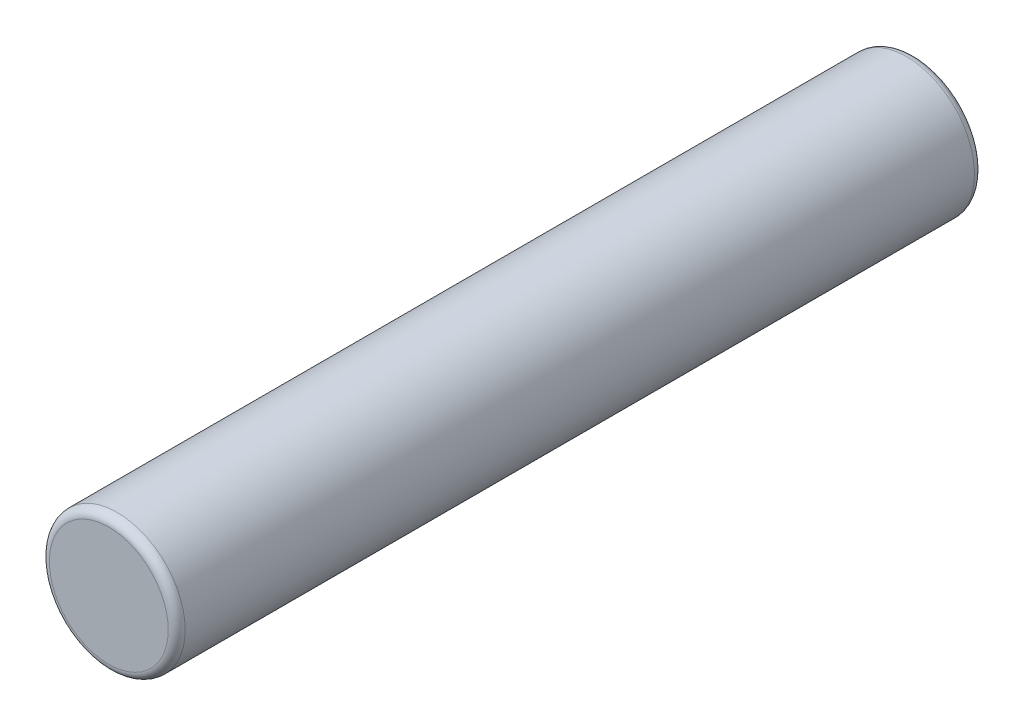
ISO-10303-21;
HEADER;
FILE_DESCRIPTION(('STEP AP214'),'2;1');
FILE_NAME('part.step','',(''),(''),'','','');
FILE_SCHEMA(('AUTOMOTIVE_DESIGN { 1 0 10303 214 1 1 1 1 }'));
ENDSEC;
DATA;
#1=APPLICATION_CONTEXT('core data for automotive mechanical design processes');
#2=APPLICATION_PROTOCOL_DEFINITION('international standard','automotive_design',2000,#1);
#3=PRODUCT_CONTEXT('',#1,'mechanical');
#4=PRODUCT('Part','Part','',(#3));
#5=PRODUCT_RELATED_PRODUCT_CATEGORY('part','',(#4));
#6=PRODUCT_DEFINITION_FORMATION('','',#4);
#7=PRODUCT_DEFINITION_CONTEXT('part definition',#1,'design');
#8=PRODUCT_DEFINITION('design','',#6,#7);
#9=PRODUCT_DEFINITION_SHAPE('','',#8);
#10=(LENGTH_UNIT() NAMED_UNIT(*) SI_UNIT(.MILLI.,.METRE.));
#11=(NAMED_UNIT(*) PLANE_ANGLE_UNIT() SI_UNIT($,.RADIAN.));
#12=(NAMED_UNIT(*) SI_UNIT($,.STERADIAN.) SOLID_ANGLE_UNIT());
#13=UNCERTAINTY_MEASURE_WITH_UNIT(LENGTH_MEASURE(1.E-05),#10,'distance_accuracy_value','');
#14=(GEOMETRIC_REPRESENTATION_CONTEXT(3) GLOBAL_UNCERTAINTY_ASSIGNED_CONTEXT((#13)) GLOBAL_UNIT_ASSIGNED_CONTEXT((#10,
#11,#12)) REPRESENTATION_CONTEXT('',''));
#15=CARTESIAN_POINT('',(0.,0.,0.));
#16=DIRECTION('',(0.,0.,1.));
#17=DIRECTION('',(1.,0.,0.));
#18=AXIS2_PLACEMENT_3D('',#15,#16,#17);
#19=CARTESIAN_POINT('',(0.,0.,9.5));
#20=DIRECTION('',(0.,0.,-1.));
#21=DIRECTION('',(-1.,0.,0.));
#22=AXIS2_PLACEMENT_3D('',#19,#20,#21);
#23=CYLINDRICAL_SURFACE('',#22,0.8);
#24=CARTESIAN_POINT('',(0.,0.,0.0999999999999994));
#25=DIRECTION('',(0.,0.,1.));
#26=DIRECTION('',(1.,0.,0.));
#27=AXIS2_PLACEMENT_3D('',#24,#25,#26);
#28=CIRCLE('',#27,0.8);
#29=CARTESIAN_POINT('',(0.8,0.,0.0999999999999994));
#30=VERTEX_POINT('',#29);
#31=EDGE_CURVE('E54',#30,#30,#28,.T.);
#32=ORIENTED_EDGE('',*,*,#31,.T.);
#33=EDGE_LOOP('',(#32));
#34=FACE_BOUND('',#33,.T.);
#35=CARTESIAN_POINT('',(0.,0.,9.4));
#36=DIRECTION('',(0.,0.,1.));
#37=DIRECTION('',(1.,0.,0.));
#38=AXIS2_PLACEMENT_3D('',#35,#36,#37);
#39=CIRCLE('',#38,0.8);
#40=CARTESIAN_POINT('',(0.8,0.,9.4));
#41=VERTEX_POINT('',#40);
#42=EDGE_CURVE('E59',#41,#41,#39,.F.);
#43=ORIENTED_EDGE('',*,*,#42,.T.);
#44=EDGE_LOOP('',(#43));
#45=FACE_BOUND('',#44,.T.);
#46=ADVANCED_FACE('F41',(#34,#45),#23,.T.);
#47=CARTESIAN_POINT('',(0.,0.,9.5));
#48=DIRECTION('',(0.,0.,1.));
#49=DIRECTION('',(1.,0.,0.));
#50=AXIS2_PLACEMENT_3D('',#47,#48,#49);
#51=PLANE('',#50);
#52=CARTESIAN_POINT('',(0.,0.,9.5));
#53=DIRECTION('',(0.,0.,1.));
#54=DIRECTION('',(1.,0.,0.));
#55=AXIS2_PLACEMENT_3D('',#52,#53,#54);
#56=CIRCLE('',#55,0.7);
#57=CARTESIAN_POINT('',(0.7,0.,9.5));
#58=VERTEX_POINT('',#57);
#59=EDGE_CURVE('E10',#58,#58,#56,.T.);
#60=ORIENTED_EDGE('',*,*,#59,.T.);
#61=EDGE_LOOP('',(#60));
#62=FACE_BOUND('',#61,.T.);
#63=ADVANCED_FACE('F76',(#62),#51,.T.);
#64=CARTESIAN_POINT('',(0.,0.,0.));
#65=DIRECTION('',(0.,0.,1.));
#66=DIRECTION('',(1.,0.,0.));
#67=AXIS2_PLACEMENT_3D('',#64,#65,#66);
#68=PLANE('',#67);
#69=CARTESIAN_POINT('',(0.,0.,0.));
#70=DIRECTION('',(0.,0.,1.));
#71=DIRECTION('',(1.,0.,0.));
#72=AXIS2_PLACEMENT_3D('',#69,#70,#71);
#73=CIRCLE('',#72,0.7);
#74=CARTESIAN_POINT('',(0.7,0.,0.));
#75=VERTEX_POINT('',#74);
#76=EDGE_CURVE('E49',#75,#75,#73,.F.);
#77=ORIENTED_EDGE('',*,*,#76,.T.);
#78=EDGE_LOOP('',(#77));
#79=FACE_BOUND('',#78,.T.);
#80=ADVANCED_FACE('F73',(#79),#68,.F.);
#81=CARTESIAN_POINT('',(0.,0.,0.0999999999999994));
#82=DIRECTION('',(0.,0.,1.));
#83=DIRECTION('',(1.,0.,0.));
#84=AXIS2_PLACEMENT_3D('',#81,#82,#83);
#85=TOROIDAL_SURFACE('',#84,0.7,0.1);
#86=ORIENTED_EDGE('',*,*,#76,.F.);
#87=EDGE_LOOP('',(#86));
#88=FACE_BOUND('',#87,.T.);
#89=ORIENTED_EDGE('',*,*,#31,.F.);
#90=EDGE_LOOP('',(#89));
#91=FACE_BOUND('',#90,.T.);
#92=ADVANCED_FACE('F69',(#88,#91),#85,.T.);
#93=CARTESIAN_POINT('',(0.,0.,9.4));
#94=DIRECTION('',(0.,0.,1.));
#95=DIRECTION('',(1.,0.,0.));
#96=AXIS2_PLACEMENT_3D('',#93,#94,#95);
#97=TOROIDAL_SURFACE('',#96,0.7,0.1);
#98=ORIENTED_EDGE('',*,*,#42,.F.);
#99=EDGE_LOOP('',(#98));
#100=FACE_BOUND('',#99,.T.);
#101=ORIENTED_EDGE('',*,*,#59,.F.);
#102=EDGE_LOOP('',(#101));
#103=FACE_BOUND('',#102,.T.);
#104=ADVANCED_FACE('F43',(#100,#103),#97,.T.);
#105=CLOSED_SHELL('',(#46,#63,#80,#92,#104));
#106=MANIFOLD_SOLID_BREP('B2',#105);
#107=ADVANCED_BREP_SHAPE_REPRESENTATION('',(#18,#106),#14);
#108=SHAPE_DEFINITION_REPRESENTATION(#9,#107);
ENDSEC;
END-ISO-10303-21;
